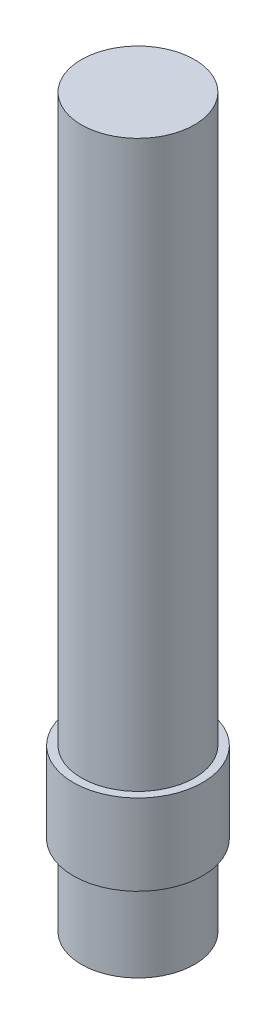
ISO-10303-21;
HEADER;
FILE_DESCRIPTION(('STEP AP214'),'2;1');
FILE_NAME('part.step','',(''),(''),'','','');
FILE_SCHEMA(('AUTOMOTIVE_DESIGN { 1 0 10303 214 1 1 1 1 }'));
ENDSEC;
DATA;
#1=APPLICATION_CONTEXT('core data for automotive mechanical design processes');
#2=APPLICATION_PROTOCOL_DEFINITION('international standard','automotive_design',2000,#1);
#3=PRODUCT_CONTEXT('',#1,'mechanical');
#4=PRODUCT('Part','Part','',(#3));
#5=PRODUCT_RELATED_PRODUCT_CATEGORY('part','',(#4));
#6=PRODUCT_DEFINITION_FORMATION('','',#4);
#7=PRODUCT_DEFINITION_CONTEXT('part definition',#1,'design');
#8=PRODUCT_DEFINITION('design','',#6,#7);
#9=PRODUCT_DEFINITION_SHAPE('','',#8);
#10=(LENGTH_UNIT() NAMED_UNIT(*) SI_UNIT(.MILLI.,.METRE.));
#11=(NAMED_UNIT(*) PLANE_ANGLE_UNIT() SI_UNIT($,.RADIAN.));
#12=(NAMED_UNIT(*) SI_UNIT($,.STERADIAN.) SOLID_ANGLE_UNIT());
#13=UNCERTAINTY_MEASURE_WITH_UNIT(LENGTH_MEASURE(1.E-05),#10,'distance_accuracy_value','');
#14=(GEOMETRIC_REPRESENTATION_CONTEXT(3) GLOBAL_UNCERTAINTY_ASSIGNED_CONTEXT((#13)) GLOBAL_UNIT_ASSIGNED_CONTEXT((#10,
#11,#12)) REPRESENTATION_CONTEXT('',''));
#15=CARTESIAN_POINT('',(0.,0.,0.));
#16=DIRECTION('',(0.,0.,1.));
#17=DIRECTION('',(1.,0.,0.));
#18=AXIS2_PLACEMENT_3D('',#15,#16,#17);
#19=CARTESIAN_POINT('',(0.,5.,0.));
#20=DIRECTION('',(0.,-1.,0.));
#21=DIRECTION('',(0.,0.,-1.));
#22=AXIS2_PLACEMENT_3D('',#19,#20,#21);
#23=CYLINDRICAL_SURFACE('',#22,3.5);
#24=CARTESIAN_POINT('',(0.,5.,0.));
#25=DIRECTION('',(0.,1.,0.));
#26=DIRECTION('',(0.,0.,1.));
#27=AXIS2_PLACEMENT_3D('',#24,#25,#26);
#28=CIRCLE('',#27,3.5);
#29=CARTESIAN_POINT('',(0.,5.,3.5));
#30=VERTEX_POINT('',#29);
#31=EDGE_CURVE('E42',#30,#30,#28,.T.);
#32=ORIENTED_EDGE('',*,*,#31,.F.);
#33=EDGE_LOOP('',(#32));
#34=FACE_BOUND('',#33,.T.);
#35=CARTESIAN_POINT('',(0.,0.,0.));
#36=DIRECTION('',(0.,1.,0.));
#37=DIRECTION('',(0.,0.,1.));
#38=AXIS2_PLACEMENT_3D('',#35,#36,#37);
#39=CIRCLE('',#38,3.5);
#40=CARTESIAN_POINT('',(0.,0.,3.5));
#41=VERTEX_POINT('',#40);
#42=EDGE_CURVE('E38',#41,#41,#39,.T.);
#43=ORIENTED_EDGE('',*,*,#42,.T.);
#44=EDGE_LOOP('',(#43));
#45=FACE_BOUND('',#44,.T.);
#46=ADVANCED_FACE('F35',(#34,#45),#23,.T.);
#47=CARTESIAN_POINT('',(0.,0.,0.));
#48=DIRECTION('',(0.,1.,0.));
#49=DIRECTION('',(0.,0.,1.));
#50=AXIS2_PLACEMENT_3D('',#47,#48,#49);
#51=PLANE('',#50);
#52=ORIENTED_EDGE('',*,*,#42,.F.);
#53=EDGE_LOOP('',(#52));
#54=FACE_BOUND('',#53,.T.);
#55=ADVANCED_FACE('F76',(#54),#51,.F.);
#56=CARTESIAN_POINT('',(0.,10.,0.));
#57=DIRECTION('',(0.,-1.,0.));
#58=DIRECTION('',(0.,0.,-1.));
#59=AXIS2_PLACEMENT_3D('',#56,#57,#58);
#60=CYLINDRICAL_SURFACE('',#59,4.);
#61=CARTESIAN_POINT('',(0.,10.,0.));
#62=DIRECTION('',(0.,1.,0.));
#63=DIRECTION('',(0.,0.,1.));
#64=AXIS2_PLACEMENT_3D('',#61,#62,#63);
#65=CIRCLE('',#64,4.);
#66=CARTESIAN_POINT('',(0.,10.,4.));
#67=VERTEX_POINT('',#66);
#68=EDGE_CURVE('E50',#67,#67,#65,.T.);
#69=ORIENTED_EDGE('',*,*,#68,.F.);
#70=EDGE_LOOP('',(#69));
#71=FACE_BOUND('',#70,.T.);
#72=CARTESIAN_POINT('',(0.,5.,0.));
#73=DIRECTION('',(0.,1.,0.));
#74=DIRECTION('',(0.,0.,1.));
#75=AXIS2_PLACEMENT_3D('',#72,#73,#74);
#76=CIRCLE('',#75,4.);
#77=CARTESIAN_POINT('',(0.,5.,4.));
#78=VERTEX_POINT('',#77);
#79=EDGE_CURVE('E53',#78,#78,#76,.T.);
#80=ORIENTED_EDGE('',*,*,#79,.T.);
#81=EDGE_LOOP('',(#80));
#82=FACE_BOUND('',#81,.T.);
#83=ADVANCED_FACE('F81',(#71,#82),#60,.T.);
#84=CARTESIAN_POINT('',(0.,10.,0.));
#85=DIRECTION('',(0.,1.,0.));
#86=DIRECTION('',(0.,0.,1.));
#87=AXIS2_PLACEMENT_3D('',#84,#85,#86);
#88=PLANE('',#87);
#89=CARTESIAN_POINT('',(0.,10.,0.));
#90=DIRECTION('',(0.,1.,0.));
#91=DIRECTION('',(0.,0.,1.));
#92=AXIS2_PLACEMENT_3D('',#89,#90,#91);
#93=CIRCLE('',#92,3.5);
#94=CARTESIAN_POINT('',(0.,10.,3.5));
#95=VERTEX_POINT('',#94);
#96=EDGE_CURVE('E10',#95,#95,#93,.T.);
#97=ORIENTED_EDGE('',*,*,#96,.F.);
#98=EDGE_LOOP('',(#97));
#99=FACE_BOUND('',#98,.T.);
#100=ORIENTED_EDGE('',*,*,#68,.T.);
#101=EDGE_LOOP('',(#100));
#102=FACE_BOUND('',#101,.T.);
#103=ADVANCED_FACE('F71',(#99,#102),#88,.T.);
#104=CARTESIAN_POINT('',(0.,5.,0.));
#105=DIRECTION('',(0.,1.,0.));
#106=DIRECTION('',(0.,0.,1.));
#107=AXIS2_PLACEMENT_3D('',#104,#105,#106);
#108=PLANE('',#107);
#109=ORIENTED_EDGE('',*,*,#31,.T.);
#110=EDGE_LOOP('',(#109));
#111=FACE_BOUND('',#110,.T.);
#112=ORIENTED_EDGE('',*,*,#79,.F.);
#113=EDGE_LOOP('',(#112));
#114=FACE_BOUND('',#113,.T.);
#115=ADVANCED_FACE('F64',(#111,#114),#108,.F.);
#116=CARTESIAN_POINT('',(0.,45.,0.));
#117=DIRECTION('',(0.,-1.,0.));
#118=DIRECTION('',(0.,0.,-1.));
#119=AXIS2_PLACEMENT_3D('',#116,#117,#118);
#120=CYLINDRICAL_SURFACE('',#119,3.5);
#121=CARTESIAN_POINT('',(0.,45.,0.));
#122=DIRECTION('',(0.,1.,0.));
#123=DIRECTION('',(0.,0.,1.));
#124=AXIS2_PLACEMENT_3D('',#121,#122,#123);
#125=CIRCLE('',#124,3.5);
#126=CARTESIAN_POINT('',(0.,45.,3.5));
#127=VERTEX_POINT('',#126);
#128=EDGE_CURVE('E49',#127,#127,#125,.T.);
#129=ORIENTED_EDGE('',*,*,#128,.F.);
#130=EDGE_LOOP('',(#129));
#131=FACE_BOUND('',#130,.T.);
#132=ORIENTED_EDGE('',*,*,#96,.T.);
#133=EDGE_LOOP('',(#132));
#134=FACE_BOUND('',#133,.T.);
#135=ADVANCED_FACE('F62',(#131,#134),#120,.T.);
#136=CARTESIAN_POINT('',(0.,45.,0.));
#137=DIRECTION('',(0.,1.,0.));
#138=DIRECTION('',(0.,0.,1.));
#139=AXIS2_PLACEMENT_3D('',#136,#137,#138);
#140=PLANE('',#139);
#141=ORIENTED_EDGE('',*,*,#128,.T.);
#142=EDGE_LOOP('',(#141));
#143=FACE_BOUND('',#142,.T.);
#144=ADVANCED_FACE('F60',(#143),#140,.T.);
#145=CLOSED_SHELL('',(#46,#55,#83,#103,#115,#135,#144));
#146=MANIFOLD_SOLID_BREP('B2',#145);
#147=ADVANCED_BREP_SHAPE_REPRESENTATION('',(#18,#146),#14);
#148=SHAPE_DEFINITION_REPRESENTATION(#9,#147);
ENDSEC;
END-ISO-10303-21;
